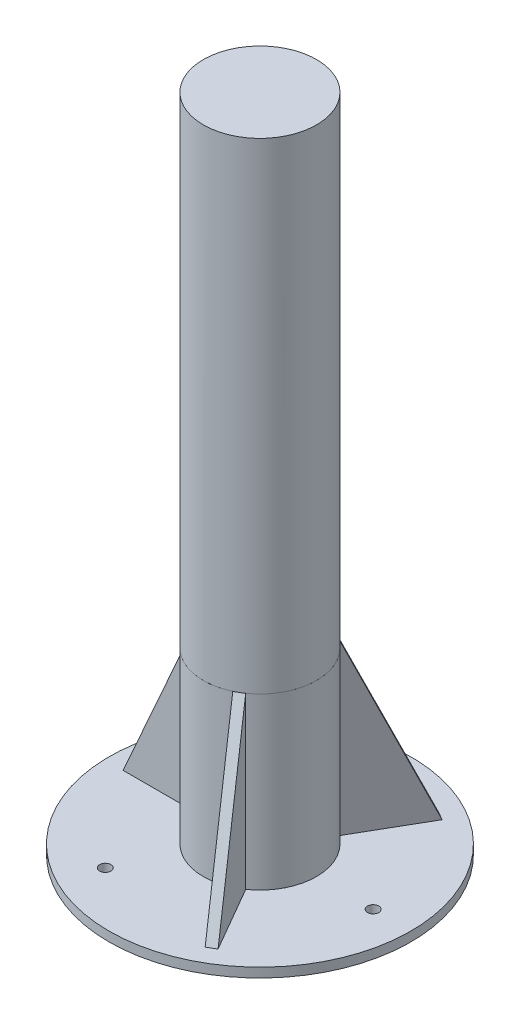
ISO-10303-21;
HEADER;
FILE_DESCRIPTION(('STEP AP214'),'2;1');
FILE_NAME('part.step','',(''),(''),'','','');
FILE_SCHEMA(('AUTOMOTIVE_DESIGN { 1 0 10303 214 1 1 1 1 }'));
ENDSEC;
DATA;
#1=APPLICATION_CONTEXT('core data for automotive mechanical design processes');
#2=APPLICATION_PROTOCOL_DEFINITION('international standard','automotive_design',2000,#1);
#3=PRODUCT_CONTEXT('',#1,'mechanical');
#4=PRODUCT('Part','Part','',(#3));
#5=PRODUCT_RELATED_PRODUCT_CATEGORY('part','',(#4));
#6=PRODUCT_DEFINITION_FORMATION('','',#4);
#7=PRODUCT_DEFINITION_CONTEXT('part definition',#1,'design');
#8=PRODUCT_DEFINITION('design','',#6,#7);
#9=PRODUCT_DEFINITION_SHAPE('','',#8);
#10=(LENGTH_UNIT() NAMED_UNIT(*) SI_UNIT(.MILLI.,.METRE.));
#11=(NAMED_UNIT(*) PLANE_ANGLE_UNIT() SI_UNIT($,.RADIAN.));
#12=(NAMED_UNIT(*) SI_UNIT($,.STERADIAN.) SOLID_ANGLE_UNIT());
#13=UNCERTAINTY_MEASURE_WITH_UNIT(LENGTH_MEASURE(1.E-05),#10,'distance_accuracy_value','');
#14=(GEOMETRIC_REPRESENTATION_CONTEXT(3) GLOBAL_UNCERTAINTY_ASSIGNED_CONTEXT((#13)) GLOBAL_UNIT_ASSIGNED_CONTEXT((#10,
#11,#12)) REPRESENTATION_CONTEXT('',''));
#15=CARTESIAN_POINT('',(0.,0.,0.));
#16=DIRECTION('',(0.,0.,1.));
#17=DIRECTION('',(1.,0.,0.));
#18=AXIS2_PLACEMENT_3D('',#15,#16,#17);
#19=CARTESIAN_POINT('',(-30.,90.,-2.5));
#20=DIRECTION('',(-0.913811548620257,0.406138466053448,0.));
#21=DIRECTION('',(-0.406138466053448,-0.913811548620257,0.));
#22=AXIS2_PLACEMENT_3D('',#19,#20,#21);
#23=PLANE('',#22);
#24=DIRECTION('',(0.,0.,1.));
#25=VECTOR('',#24,1.);
#26=CARTESIAN_POINT('',(-70.,0.,-2.5));
#27=LINE('',#26,#25);
#28=CARTESIAN_POINT('',(-70.,0.,-2.5));
#29=VERTEX_POINT('',#28);
#30=CARTESIAN_POINT('',(-70.,0.,2.5));
#31=VERTEX_POINT('',#30);
#32=EDGE_CURVE('E48',#29,#31,#27,.T.);
#33=ORIENTED_EDGE('',*,*,#32,.T.);
#34=DIRECTION('',(-0.406138466053448,-0.913811548620257,0.));
#35=VECTOR('',#34,1.);
#36=CARTESIAN_POINT('',(-30.,90.,2.5));
#37=LINE('',#36,#35);
#38=CARTESIAN_POINT('',(-30.,90.,2.5));
#39=VERTEX_POINT('',#38);
#40=EDGE_CURVE('E79',#39,#31,#37,.T.);
#41=ORIENTED_EDGE('',*,*,#40,.F.);
#42=DIRECTION('',(0.,0.,1.));
#43=VECTOR('',#42,1.);
#44=CARTESIAN_POINT('',(-30.,90.,-2.5));
#45=LINE('',#44,#43);
#46=CARTESIAN_POINT('',(-30.,90.,-2.5));
#47=VERTEX_POINT('',#46);
#48=EDGE_CURVE('E12',#47,#39,#45,.T.);
#49=ORIENTED_EDGE('',*,*,#48,.F.);
#50=DIRECTION('',(-0.406138466053448,-0.913811548620257,0.));
#51=VECTOR('',#50,1.);
#52=CARTESIAN_POINT('',(-30.,90.,-2.5));
#53=LINE('',#52,#51);
#54=EDGE_CURVE('E80',#47,#29,#53,.T.);
#55=ORIENTED_EDGE('',*,*,#54,.T.);
#56=EDGE_LOOP('',(#33,#41,#49,#55));
#57=FACE_BOUND('',#56,.T.);
#58=ADVANCED_FACE('F45',(#57),#23,.T.);
#59=CARTESIAN_POINT('',(-30.,0.,-2.5));
#60=DIRECTION('',(1.,0.,0.));
#61=DIRECTION('',(0.,0.,-1.));
#62=AXIS2_PLACEMENT_3D('',#59,#60,#61);
#63=PLANE('',#62);
#64=ORIENTED_EDGE('',*,*,#48,.T.);
#65=DIRECTION('',(0.,1.,0.));
#66=VECTOR('',#65,1.);
#67=CARTESIAN_POINT('',(-30.,0.,2.5));
#68=LINE('',#67,#66);
#69=CARTESIAN_POINT('',(-30.,0.,2.5));
#70=VERTEX_POINT('',#69);
#71=EDGE_CURVE('E89',#70,#39,#68,.T.);
#72=ORIENTED_EDGE('',*,*,#71,.F.);
#73=DIRECTION('',(0.,0.,1.));
#74=VECTOR('',#73,1.);
#75=CARTESIAN_POINT('',(-30.,0.,-2.5));
#76=LINE('',#75,#74);
#77=CARTESIAN_POINT('',(-30.,0.,-2.5));
#78=VERTEX_POINT('',#77);
#79=EDGE_CURVE('E53',#78,#70,#76,.T.);
#80=ORIENTED_EDGE('',*,*,#79,.F.);
#81=DIRECTION('',(0.,1.,0.));
#82=VECTOR('',#81,1.);
#83=CARTESIAN_POINT('',(-30.,0.,-2.5));
#84=LINE('',#83,#82);
#85=EDGE_CURVE('E83',#78,#47,#84,.T.);
#86=ORIENTED_EDGE('',*,*,#85,.T.);
#87=EDGE_LOOP('',(#64,#72,#80,#86));
#88=FACE_BOUND('',#87,.T.);
#89=ADVANCED_FACE('F99',(#88),#63,.T.);
#90=CARTESIAN_POINT('',(-70.,0.,-2.5));
#91=DIRECTION('',(0.,-1.,0.));
#92=DIRECTION('',(0.,0.,-1.));
#93=AXIS2_PLACEMENT_3D('',#90,#91,#92);
#94=PLANE('',#93);
#95=ORIENTED_EDGE('',*,*,#79,.T.);
#96=DIRECTION('',(1.,0.,0.));
#97=VECTOR('',#96,1.);
#98=CARTESIAN_POINT('',(-70.,0.,2.5));
#99=LINE('',#98,#97);
#100=EDGE_CURVE('E85',#31,#70,#99,.T.);
#101=ORIENTED_EDGE('',*,*,#100,.F.);
#102=ORIENTED_EDGE('',*,*,#32,.F.);
#103=DIRECTION('',(1.,0.,0.));
#104=VECTOR('',#103,1.);
#105=CARTESIAN_POINT('',(-70.,0.,-2.5));
#106=LINE('',#105,#104);
#107=EDGE_CURVE('E96',#29,#78,#106,.T.);
#108=ORIENTED_EDGE('',*,*,#107,.T.);
#109=EDGE_LOOP('',(#95,#101,#102,#108));
#110=FACE_BOUND('',#109,.T.);
#111=ADVANCED_FACE('F86',(#110),#94,.T.);
#112=CARTESIAN_POINT('',(0.,0.,-2.5));
#113=DIRECTION('',(0.,0.,1.));
#114=DIRECTION('',(1.,0.,0.));
#115=AXIS2_PLACEMENT_3D('',#112,#113,#114);
#116=PLANE('',#115);
#117=ORIENTED_EDGE('',*,*,#54,.F.);
#118=ORIENTED_EDGE('',*,*,#85,.F.);
#119=ORIENTED_EDGE('',*,*,#107,.F.);
#120=EDGE_LOOP('',(#117,#118,#119));
#121=FACE_BOUND('',#120,.T.);
#122=ADVANCED_FACE('F101',(#121),#116,.F.);
#123=CARTESIAN_POINT('',(0.,0.,2.5));
#124=DIRECTION('',(0.,0.,1.));
#125=DIRECTION('',(1.,0.,0.));
#126=AXIS2_PLACEMENT_3D('',#123,#124,#125);
#127=PLANE('',#126);
#128=ORIENTED_EDGE('',*,*,#40,.T.);
#129=ORIENTED_EDGE('',*,*,#100,.T.);
#130=ORIENTED_EDGE('',*,*,#71,.T.);
#131=EDGE_LOOP('',(#128,#129,#130));
#132=FACE_BOUND('',#131,.T.);
#133=ADVANCED_FACE('F91',(#132),#127,.T.);
#134=CLOSED_SHELL('',(#58,#89,#111,#122,#133));
#135=MANIFOLD_SOLID_BREP('B2',#134);
#136=CARTESIAN_POINT('',(0.,345.,0.));
#137=DIRECTION('',(0.,-1.,0.));
#138=DIRECTION('',(0.,0.,-1.));
#139=AXIS2_PLACEMENT_3D('',#136,#137,#138);
#140=CYLINDRICAL_SURFACE('',#139,30.);
#141=CARTESIAN_POINT('',(0.,345.,0.));
#142=DIRECTION('',(0.,1.,0.));
#143=DIRECTION('',(0.,0.,1.));
#144=AXIS2_PLACEMENT_3D('',#141,#142,#143);
#145=CIRCLE('',#144,30.);
#146=CARTESIAN_POINT('',(0.,345.,30.));
#147=VERTEX_POINT('',#146);
#148=EDGE_CURVE('E43',#147,#147,#145,.T.);
#149=ORIENTED_EDGE('',*,*,#148,.F.);
#150=EDGE_LOOP('',(#149));
#151=FACE_BOUND('',#150,.T.);
#152=CARTESIAN_POINT('',(0.,90.,0.));
#153=DIRECTION('',(0.,1.,0.));
#154=DIRECTION('',(0.,0.,1.));
#155=AXIS2_PLACEMENT_3D('',#152,#153,#154);
#156=CIRCLE('',#155,30.);
#157=CARTESIAN_POINT('',(15.0000000000001,90.,-25.9807621135331));
#158=VERTEX_POINT('',#157);
#159=CARTESIAN_POINT('',(14.9999999999998,90.,25.9807621135333));
#160=VERTEX_POINT('',#159);
#161=EDGE_CURVE('E153',#158,#160,#156,.T.);
#162=ORIENTED_EDGE('',*,*,#161,.T.);
#163=EDGE_CURVE('E163',#160,#158,#156,.T.);
#164=ORIENTED_EDGE('',*,*,#163,.T.);
#165=EDGE_LOOP('',(#162,#164));
#166=FACE_BOUND('',#165,.T.);
#167=ADVANCED_FACE('F150',(#151,#166),#140,.T.);
#168=CARTESIAN_POINT('',(0.,345.,0.));
#169=DIRECTION('',(0.,1.,0.));
#170=DIRECTION('',(0.,0.,1.));
#171=AXIS2_PLACEMENT_3D('',#168,#169,#170);
#172=PLANE('',#171);
#173=ORIENTED_EDGE('',*,*,#148,.T.);
#174=EDGE_LOOP('',(#173));
#175=FACE_BOUND('',#174,.T.);
#176=ADVANCED_FACE('F168',(#175),#172,.T.);
#177=CARTESIAN_POINT('',(0.,90.,0.));
#178=DIRECTION('',(0.,1.,0.));
#179=DIRECTION('',(0.,0.,1.));
#180=AXIS2_PLACEMENT_3D('',#177,#178,#179);
#181=PLANE('',#180);
#182=ORIENTED_EDGE('',*,*,#161,.F.);
#183=ORIENTED_EDGE('',*,*,#163,.F.);
#184=EDGE_LOOP('',(#182,#183));
#185=FACE_BOUND('',#184,.T.);
#186=ADVANCED_FACE('F166',(#185),#181,.F.);
#187=CLOSED_SHELL('',(#167,#176,#186));
#188=MANIFOLD_SOLID_BREP('B6',#187);
#189=CARTESIAN_POINT('',(0.,90.,0.));
#190=DIRECTION('',(0.,-1.,0.));
#191=DIRECTION('',(0.,0.,-1.));
#192=AXIS2_PLACEMENT_3D('',#189,#190,#191);
#193=CYLINDRICAL_SURFACE('',#192,30.);
#194=CARTESIAN_POINT('',(0.,0.,0.));
#195=DIRECTION('',(0.,1.,0.));
#196=DIRECTION('',(0.,0.,1.));
#197=AXIS2_PLACEMENT_3D('',#194,#195,#196);
#198=CIRCLE('',#197,30.);
#199=CARTESIAN_POINT('',(0.,0.,30.));
#200=VERTEX_POINT('',#199);
#201=EDGE_CURVE('E207',#200,#200,#198,.T.);
#202=ORIENTED_EDGE('',*,*,#201,.T.);
#203=EDGE_LOOP('',(#202));
#204=FACE_BOUND('',#203,.T.);
#205=CARTESIAN_POINT('',(0.,90.,0.));
#206=DIRECTION('',(0.,1.,0.));
#207=DIRECTION('',(0.,0.,1.));
#208=AXIS2_PLACEMENT_3D('',#205,#206,#207);
#209=CIRCLE('',#208,30.);
#210=CARTESIAN_POINT('',(0.,90.,30.));
#211=VERTEX_POINT('',#210);
#212=EDGE_CURVE('E149',#211,#211,#209,.T.);
#213=ORIENTED_EDGE('',*,*,#212,.F.);
#214=EDGE_LOOP('',(#213));
#215=FACE_BOUND('',#214,.T.);
#216=ADVANCED_FACE('F204',(#204,#215),#193,.T.);
#217=CARTESIAN_POINT('',(0.,90.,0.));
#218=DIRECTION('',(0.,1.,0.));
#219=DIRECTION('',(0.,0.,1.));
#220=AXIS2_PLACEMENT_3D('',#217,#218,#219);
#221=PLANE('',#220);
#222=ORIENTED_EDGE('',*,*,#212,.T.);
#223=EDGE_LOOP('',(#222));
#224=FACE_BOUND('',#223,.T.);
#225=ADVANCED_FACE('F220',(#224),#221,.T.);
#226=CARTESIAN_POINT('',(0.,0.,0.));
#227=DIRECTION('',(0.,1.,0.));
#228=DIRECTION('',(0.,0.,1.));
#229=AXIS2_PLACEMENT_3D('',#226,#227,#228);
#230=PLANE('',#229);
#231=ORIENTED_EDGE('',*,*,#201,.F.);
#232=EDGE_LOOP('',(#231));
#233=FACE_BOUND('',#232,.T.);
#234=ADVANCED_FACE('F218',(#233),#230,.F.);
#235=CLOSED_SHELL('',(#216,#225,#234));
#236=MANIFOLD_SOLID_BREP('B37',#235);
#237=CARTESIAN_POINT('',(0.,0.,0.));
#238=DIRECTION('',(0.,1.,0.));
#239=DIRECTION('',(0.,0.,1.));
#240=AXIS2_PLACEMENT_3D('',#237,#238,#239);
#241=PLANE('',#240);
#242=CARTESIAN_POINT('',(-30.0000000000006,0.,-51.961524227066));
#243=DIRECTION('',(0.,1.,0.));
#244=DIRECTION('',(0.,0.,1.));
#245=AXIS2_PLACEMENT_3D('',#242,#243,#244);
#246=CIRCLE('',#245,3.);
#247=CARTESIAN_POINT('',(-30.0000000000006,0.,-48.961524227066));
#248=VERTEX_POINT('',#247);
#249=EDGE_CURVE('E415',#248,#248,#246,.T.);
#250=ORIENTED_EDGE('',*,*,#249,.F.);
#251=EDGE_LOOP('',(#250));
#252=FACE_BOUND('',#251,.T.);
#253=CARTESIAN_POINT('',(60.0000000000015,0.,-3.21723326152867E-12));
#254=DIRECTION('',(0.,1.,0.));
#255=DIRECTION('',(0.,0.,1.));
#256=AXIS2_PLACEMENT_3D('',#253,#254,#255);
#257=CIRCLE('',#256,3.00000000000309);
#258=CARTESIAN_POINT('',(60.0000000000015,0.,2.99999999999987));
#259=VERTEX_POINT('',#258);
#260=EDGE_CURVE('E420',#259,#259,#257,.T.);
#261=ORIENTED_EDGE('',*,*,#260,.F.);
#262=EDGE_LOOP('',(#261));
#263=FACE_BOUND('',#262,.T.);
#264=CARTESIAN_POINT('',(-29.9999999999965,0.,51.9615242270667));
#265=DIRECTION('',(0.,1.,0.));
#266=DIRECTION('',(0.,0.,1.));
#267=AXIS2_PLACEMENT_3D('',#264,#265,#266);
#268=CIRCLE('',#267,3.00000000000271);
#269=CARTESIAN_POINT('',(-29.9999999999965,0.,54.9615242270694));
#270=VERTEX_POINT('',#269);
#271=EDGE_CURVE('E428',#270,#270,#268,.T.);
#272=ORIENTED_EDGE('',*,*,#271,.F.);
#273=EDGE_LOOP('',(#272));
#274=FACE_BOUND('',#273,.T.);
#275=CARTESIAN_POINT('',(0.,0.,0.));
#276=DIRECTION('',(0.,1.,0.));
#277=DIRECTION('',(0.,0.,1.));
#278=AXIS2_PLACEMENT_3D('',#275,#276,#277);
#279=CIRCLE('',#278,80.);
#280=CARTESIAN_POINT('',(0.,0.,80.));
#281=VERTEX_POINT('',#280);
#282=EDGE_CURVE('E248',#281,#281,#279,.T.);
#283=ORIENTED_EDGE('',*,*,#282,.T.);
#284=EDGE_LOOP('',(#283));
#285=FACE_BOUND('',#284,.T.);
#286=DIRECTION('',(-0.866025403784436,0.,-0.500000000000004));
#287=VECTOR('',#286,1.);
#288=CARTESIAN_POINT('',(37.1650635094614,0.,-59.3717782649106));
#289=LINE('',#288,#287);
#290=CARTESIAN_POINT('',(37.1650635094614,0.,-59.3717782649105));
#291=VERTEX_POINT('',#290);
#292=CARTESIAN_POINT('',(32.8349364905392,0.,-61.8717782649106));
#293=VERTEX_POINT('',#292);
#294=EDGE_CURVE('E323',#291,#293,#289,.T.);
#295=ORIENTED_EDGE('',*,*,#294,.F.);
#296=DIRECTION('',(-0.500000000000004,0.,0.866025403784436));
#297=VECTOR('',#296,1.);
#298=CARTESIAN_POINT('',(37.1650635094614,0.,-59.3717782649106));
#299=LINE('',#298,#297);
#300=CARTESIAN_POINT('',(17.1650635094612,0.,-24.7307621135331));
#301=VERTEX_POINT('',#300);
#302=EDGE_CURVE('E346',#291,#301,#299,.T.);
#303=ORIENTED_EDGE('',*,*,#302,.T.);
#304=DIRECTION('',(-0.866025403784436,0.,-0.500000000000004));
#305=VECTOR('',#304,1.);
#306=CARTESIAN_POINT('',(17.1650635094612,0.,-24.7307621135331));
#307=LINE('',#306,#305);
#308=CARTESIAN_POINT('',(12.834936490539,0.,-27.2307621135331));
#309=VERTEX_POINT('',#308);
#310=EDGE_CURVE('E338',#301,#309,#307,.T.);
#311=ORIENTED_EDGE('',*,*,#310,.T.);
#312=DIRECTION('',(-0.500000000000004,0.,0.866025403784436));
#313=VECTOR('',#312,1.);
#314=CARTESIAN_POINT('',(32.8349364905392,0.,-61.8717782649106));
#315=LINE('',#314,#313);
#316=EDGE_CURVE('E343',#293,#309,#315,.T.);
#317=ORIENTED_EDGE('',*,*,#316,.F.);
#318=EDGE_LOOP('',(#295,#303,#311,#317));
#319=FACE_BOUND('',#318,.T.);
#320=DIRECTION('',(0.866025403784443,0.,-0.499999999999992));
#321=VECTOR('',#320,1.);
#322=CARTESIAN_POINT('',(32.8349364905383,0.,61.871778264911));
#323=LINE('',#322,#321);
#324=CARTESIAN_POINT('',(32.8349364905383,0.,61.871778264911));
#325=VERTEX_POINT('',#324);
#326=CARTESIAN_POINT('',(37.1650635094605,0.,59.3717782649111));
#327=VERTEX_POINT('',#326);
#328=EDGE_CURVE('E259',#325,#327,#323,.T.);
#329=ORIENTED_EDGE('',*,*,#328,.F.);
#330=DIRECTION('',(-0.499999999999992,0.,-0.866025403784443));
#331=VECTOR('',#330,1.);
#332=CARTESIAN_POINT('',(32.8349364905383,0.,61.871778264911));
#333=LINE('',#332,#331);
#334=CARTESIAN_POINT('',(12.8349364905386,0.,27.2307621135333));
#335=VERTEX_POINT('',#334);
#336=EDGE_CURVE('E264',#325,#335,#333,.T.);
#337=ORIENTED_EDGE('',*,*,#336,.T.);
#338=DIRECTION('',(0.866025403784443,0.,-0.499999999999992));
#339=VECTOR('',#338,1.);
#340=CARTESIAN_POINT('',(12.8349364905386,0.,27.2307621135333));
#341=LINE('',#340,#339);
#342=CARTESIAN_POINT('',(17.1650635094609,0.,24.7307621135333));
#343=VERTEX_POINT('',#342);
#344=EDGE_CURVE('E315',#335,#343,#341,.T.);
#345=ORIENTED_EDGE('',*,*,#344,.T.);
#346=DIRECTION('',(-0.499999999999992,0.,-0.866025403784443));
#347=VECTOR('',#346,1.);
#348=CARTESIAN_POINT('',(37.1650635094605,0.,59.3717782649111));
#349=LINE('',#348,#347);
#350=EDGE_CURVE('E314',#327,#343,#349,.T.);
#351=ORIENTED_EDGE('',*,*,#350,.F.);
#352=EDGE_LOOP('',(#329,#337,#345,#351));
#353=FACE_BOUND('',#352,.T.);
#354=ADVANCED_FACE('F244',(#252,#263,#274,#285,#319,#353),#241,.T.);
#355=CARTESIAN_POINT('',(0.,-5.,0.));
#356=DIRECTION('',(0.,1.,0.));
#357=DIRECTION('',(0.,0.,1.));
#358=AXIS2_PLACEMENT_3D('',#355,#356,#357);
#359=CYLINDRICAL_SURFACE('',#358,80.);
#360=CARTESIAN_POINT('',(0.,-5.,0.));
#361=DIRECTION('',(0.,1.,0.));
#362=DIRECTION('',(0.,0.,1.));
#363=AXIS2_PLACEMENT_3D('',#360,#361,#362);
#364=CIRCLE('',#363,80.);
#365=CARTESIAN_POINT('',(0.,-5.,80.));
#366=VERTEX_POINT('',#365);
#367=EDGE_CURVE('E202',#366,#366,#364,.T.);
#368=ORIENTED_EDGE('',*,*,#367,.T.);
#369=EDGE_LOOP('',(#368));
#370=FACE_BOUND('',#369,.T.);
#371=ORIENTED_EDGE('',*,*,#282,.F.);
#372=EDGE_LOOP('',(#371));
#373=FACE_BOUND('',#372,.T.);
#374=ADVANCED_FACE('F246',(#370,#373),#359,.T.);
#375=CARTESIAN_POINT('',(0.,-5.,0.));
#376=DIRECTION('',(0.,1.,0.));
#377=DIRECTION('',(0.,0.,1.));
#378=AXIS2_PLACEMENT_3D('',#375,#376,#377);
#379=PLANE('',#378);
#380=CARTESIAN_POINT('',(-30.0000000000006,-5.,-51.961524227066));
#381=DIRECTION('',(0.,1.,0.));
#382=DIRECTION('',(0.,0.,1.));
#383=AXIS2_PLACEMENT_3D('',#380,#381,#382);
#384=CIRCLE('',#383,3.);
#385=CARTESIAN_POINT('',(-30.0000000000006,-5.,-48.961524227066));
#386=VERTEX_POINT('',#385);
#387=EDGE_CURVE('E413',#386,#386,#384,.T.);
#388=ORIENTED_EDGE('',*,*,#387,.T.);
#389=EDGE_LOOP('',(#388));
#390=FACE_BOUND('',#389,.T.);
#391=CARTESIAN_POINT('',(60.0000000000015,-5.,-3.21723326152867E-12));
#392=DIRECTION('',(0.,1.,0.));
#393=DIRECTION('',(0.,0.,1.));
#394=AXIS2_PLACEMENT_3D('',#391,#392,#393);
#395=CIRCLE('',#394,3.00000000000309);
#396=CARTESIAN_POINT('',(60.0000000000015,-5.,2.99999999999987));
#397=VERTEX_POINT('',#396);
#398=EDGE_CURVE('E416',#397,#397,#395,.T.);
#399=ORIENTED_EDGE('',*,*,#398,.T.);
#400=EDGE_LOOP('',(#399));
#401=FACE_BOUND('',#400,.T.);
#402=CARTESIAN_POINT('',(-29.9999999999965,-5.,51.9615242270667));
#403=DIRECTION('',(0.,1.,0.));
#404=DIRECTION('',(0.,0.,1.));
#405=AXIS2_PLACEMENT_3D('',#402,#403,#404);
#406=CIRCLE('',#405,3.00000000000271);
#407=CARTESIAN_POINT('',(-29.9999999999965,-5.,54.9615242270694));
#408=VERTEX_POINT('',#407);
#409=EDGE_CURVE('E425',#408,#408,#406,.T.);
#410=ORIENTED_EDGE('',*,*,#409,.T.);
#411=EDGE_LOOP('',(#410));
#412=FACE_BOUND('',#411,.T.);
#413=ORIENTED_EDGE('',*,*,#367,.F.);
#414=EDGE_LOOP('',(#413));
#415=FACE_BOUND('',#414,.T.);
#416=ADVANCED_FACE('F355',(#390,#401,#412,#415),#379,.F.);
#417=CARTESIAN_POINT('',(17.1650635094612,90.,-24.7307621135331));
#418=DIRECTION('',(0.456905774310132,0.406138466053448,-0.791384015376739));
#419=DIRECTION('',(0.203069233026726,-0.913811548620257,-0.351726229056329));
#420=AXIS2_PLACEMENT_3D('',#417,#418,#419);
#421=PLANE('',#420);
#422=ORIENTED_EDGE('',*,*,#294,.T.);
#423=DIRECTION('',(0.203069233026726,-0.913811548620257,-0.351726229056329));
#424=VECTOR('',#423,1.);
#425=CARTESIAN_POINT('',(12.834936490539,90.,-27.2307621135331));
#426=LINE('',#425,#424);
#427=CARTESIAN_POINT('',(12.834936490539,90.,-27.2307621135331));
#428=VERTEX_POINT('',#427);
#429=EDGE_CURVE('E326',#428,#293,#426,.T.);
#430=ORIENTED_EDGE('',*,*,#429,.F.);
#431=DIRECTION('',(-0.866025403784436,0.,-0.500000000000004));
#432=VECTOR('',#431,1.);
#433=CARTESIAN_POINT('',(17.1650635094612,90.,-24.7307621135331));
#434=LINE('',#433,#432);
#435=CARTESIAN_POINT('',(17.1650635094612,90.,-24.7307621135331));
#436=VERTEX_POINT('',#435);
#437=EDGE_CURVE('E329',#436,#428,#434,.T.);
#438=ORIENTED_EDGE('',*,*,#437,.F.);
#439=DIRECTION('',(0.203069233026726,-0.913811548620257,-0.351726229056329));
#440=VECTOR('',#439,1.);
#441=CARTESIAN_POINT('',(17.1650635094612,90.,-24.7307621135331));
#442=LINE('',#441,#440);
#443=EDGE_CURVE('E332',#436,#291,#442,.T.);
#444=ORIENTED_EDGE('',*,*,#443,.T.);
#445=EDGE_LOOP('',(#422,#430,#438,#444));
#446=FACE_BOUND('',#445,.T.);
#447=ADVANCED_FACE('F361',(#446),#421,.T.);
#448=CARTESIAN_POINT('',(17.1650635094612,0.,-24.7307621135331));
#449=DIRECTION('',(-0.500000000000004,0.,0.866025403784436));
#450=DIRECTION('',(0.866025403784436,0.,0.500000000000004));
#451=AXIS2_PLACEMENT_3D('',#448,#449,#450);
#452=PLANE('',#451);
#453=ORIENTED_EDGE('',*,*,#437,.T.);
#454=DIRECTION('',(0.,1.,0.));
#455=VECTOR('',#454,1.);
#456=CARTESIAN_POINT('',(12.834936490539,0.,-27.2307621135331));
#457=LINE('',#456,#455);
#458=EDGE_CURVE('E335',#309,#428,#457,.T.);
#459=ORIENTED_EDGE('',*,*,#458,.F.);
#460=ORIENTED_EDGE('',*,*,#310,.F.);
#461=DIRECTION('',(0.,1.,0.));
#462=VECTOR('',#461,1.);
#463=CARTESIAN_POINT('',(17.1650635094612,0.,-24.7307621135331));
#464=LINE('',#463,#462);
#465=EDGE_CURVE('E340',#301,#436,#464,.T.);
#466=ORIENTED_EDGE('',*,*,#465,.T.);
#467=EDGE_LOOP('',(#453,#459,#460,#466));
#468=FACE_BOUND('',#467,.T.);
#469=ADVANCED_FACE('F379',(#468),#452,.T.);
#470=CARTESIAN_POINT('',(2.16506350946109,0.,1.25000000000001));
#471=DIRECTION('',(-0.866025403784436,0.,-0.500000000000004));
#472=DIRECTION('',(-0.500000000000004,0.,0.866025403784436));
#473=AXIS2_PLACEMENT_3D('',#470,#471,#472);
#474=PLANE('',#473);
#475=ORIENTED_EDGE('',*,*,#443,.F.);
#476=ORIENTED_EDGE('',*,*,#465,.F.);
#477=ORIENTED_EDGE('',*,*,#302,.F.);
#478=EDGE_LOOP('',(#475,#476,#477));
#479=FACE_BOUND('',#478,.T.);
#480=ADVANCED_FACE('F375',(#479),#474,.F.);
#481=CARTESIAN_POINT('',(-2.16506350946109,0.,-1.25000000000001));
#482=DIRECTION('',(-0.866025403784436,0.,-0.500000000000004));
#483=DIRECTION('',(-0.500000000000004,0.,0.866025403784436));
#484=AXIS2_PLACEMENT_3D('',#481,#482,#483);
#485=PLANE('',#484);
#486=ORIENTED_EDGE('',*,*,#429,.T.);
#487=ORIENTED_EDGE('',*,*,#316,.T.);
#488=ORIENTED_EDGE('',*,*,#458,.T.);
#489=EDGE_LOOP('',(#486,#487,#488));
#490=FACE_BOUND('',#489,.T.);
#491=ADVANCED_FACE('F364',(#490),#485,.T.);
#492=CARTESIAN_POINT('',(12.8349364905386,90.,27.2307621135333));
#493=DIRECTION('',(0.456905774310121,0.406138466053448,0.791384015376746));
#494=DIRECTION('',(0.203069233026721,-0.913811548620257,0.351726229056331));
#495=AXIS2_PLACEMENT_3D('',#492,#493,#494);
#496=PLANE('',#495);
#497=ORIENTED_EDGE('',*,*,#328,.T.);
#498=DIRECTION('',(0.203069233026721,-0.913811548620257,0.351726229056331));
#499=VECTOR('',#498,1.);
#500=CARTESIAN_POINT('',(17.1650635094609,90.,24.7307621135333));
#501=LINE('',#500,#499);
#502=CARTESIAN_POINT('',(17.1650635094609,90.,24.7307621135333));
#503=VERTEX_POINT('',#502);
#504=EDGE_CURVE('E295',#503,#327,#501,.T.);
#505=ORIENTED_EDGE('',*,*,#504,.F.);
#506=DIRECTION('',(0.866025403784443,0.,-0.499999999999992));
#507=VECTOR('',#506,1.);
#508=CARTESIAN_POINT('',(12.8349364905386,90.,27.2307621135333));
#509=LINE('',#508,#507);
#510=CARTESIAN_POINT('',(12.8349364905386,90.,27.2307621135333));
#511=VERTEX_POINT('',#510);
#512=EDGE_CURVE('E298',#511,#503,#509,.T.);
#513=ORIENTED_EDGE('',*,*,#512,.F.);
#514=DIRECTION('',(0.203069233026721,-0.913811548620257,0.351726229056331));
#515=VECTOR('',#514,1.);
#516=CARTESIAN_POINT('',(12.8349364905386,90.,27.2307621135333));
#517=LINE('',#516,#515);
#518=EDGE_CURVE('E311',#511,#325,#517,.T.);
#519=ORIENTED_EDGE('',*,*,#518,.T.);
#520=EDGE_LOOP('',(#497,#505,#513,#519));
#521=FACE_BOUND('',#520,.T.);
#522=ADVANCED_FACE('F297',(#521),#496,.T.);
#523=CARTESIAN_POINT('',(12.8349364905386,0.,27.2307621135333));
#524=DIRECTION('',(-0.499999999999992,0.,-0.866025403784443));
#525=DIRECTION('',(-0.866025403784443,0.,0.499999999999992));
#526=AXIS2_PLACEMENT_3D('',#523,#524,#525);
#527=PLANE('',#526);
#528=ORIENTED_EDGE('',*,*,#512,.T.);
#529=DIRECTION('',(0.,1.,0.));
#530=VECTOR('',#529,1.);
#531=CARTESIAN_POINT('',(17.1650635094609,0.,24.7307621135333));
#532=LINE('',#531,#530);
#533=EDGE_CURVE('E308',#343,#503,#532,.T.);
#534=ORIENTED_EDGE('',*,*,#533,.F.);
#535=ORIENTED_EDGE('',*,*,#344,.F.);
#536=DIRECTION('',(0.,1.,0.));
#537=VECTOR('',#536,1.);
#538=CARTESIAN_POINT('',(12.8349364905386,0.,27.2307621135333));
#539=LINE('',#538,#537);
#540=EDGE_CURVE('E310',#335,#511,#539,.T.);
#541=ORIENTED_EDGE('',*,*,#540,.T.);
#542=EDGE_LOOP('',(#528,#534,#535,#541));
#543=FACE_BOUND('',#542,.T.);
#544=ADVANCED_FACE('F307',(#543),#527,.T.);
#545=CARTESIAN_POINT('',(-2.16506350946111,0.,1.24999999999998));
#546=DIRECTION('',(0.866025403784443,0.,-0.499999999999992));
#547=DIRECTION('',(-0.499999999999992,0.,-0.866025403784443));
#548=AXIS2_PLACEMENT_3D('',#545,#546,#547);
#549=PLANE('',#548);
#550=ORIENTED_EDGE('',*,*,#518,.F.);
#551=ORIENTED_EDGE('',*,*,#540,.F.);
#552=ORIENTED_EDGE('',*,*,#336,.F.);
#553=EDGE_LOOP('',(#550,#551,#552));
#554=FACE_BOUND('',#553,.T.);
#555=ADVANCED_FACE('F390',(#554),#549,.F.);
#556=CARTESIAN_POINT('',(2.16506350946111,0.,-1.24999999999998));
#557=DIRECTION('',(0.866025403784443,0.,-0.499999999999992));
#558=DIRECTION('',(-0.499999999999992,0.,-0.866025403784443));
#559=AXIS2_PLACEMENT_3D('',#556,#557,#558);
#560=PLANE('',#559);
#561=ORIENTED_EDGE('',*,*,#504,.T.);
#562=ORIENTED_EDGE('',*,*,#350,.T.);
#563=ORIENTED_EDGE('',*,*,#533,.T.);
#564=EDGE_LOOP('',(#561,#562,#563));
#565=FACE_BOUND('',#564,.T.);
#566=ADVANCED_FACE('F313',(#565),#560,.T.);
#567=CARTESIAN_POINT('',(-29.9999999999965,-5.,51.9615242270667));
#568=DIRECTION('',(0.,1.,0.));
#569=DIRECTION('',(0.,0.,1.));
#570=AXIS2_PLACEMENT_3D('',#567,#568,#569);
#571=CYLINDRICAL_SURFACE('',#570,3.00000000000271);
#572=ORIENTED_EDGE('',*,*,#409,.F.);
#573=EDGE_LOOP('',(#572));
#574=FACE_BOUND('',#573,.T.);
#575=ORIENTED_EDGE('',*,*,#271,.T.);
#576=EDGE_LOOP('',(#575));
#577=FACE_BOUND('',#576,.T.);
#578=ADVANCED_FACE('F389',(#574,#577),#571,.F.);
#579=CARTESIAN_POINT('',(60.0000000000015,-5.,-3.21723326152867E-12));
#580=DIRECTION('',(0.,1.,0.));
#581=DIRECTION('',(0.,0.,1.));
#582=AXIS2_PLACEMENT_3D('',#579,#580,#581);
#583=CYLINDRICAL_SURFACE('',#582,3.00000000000309);
#584=ORIENTED_EDGE('',*,*,#398,.F.);
#585=EDGE_LOOP('',(#584));
#586=FACE_BOUND('',#585,.T.);
#587=ORIENTED_EDGE('',*,*,#260,.T.);
#588=EDGE_LOOP('',(#587));
#589=FACE_BOUND('',#588,.T.);
#590=ADVANCED_FACE('F400',(#586,#589),#583,.F.);
#591=CARTESIAN_POINT('',(-30.0000000000006,-5.,-51.961524227066));
#592=DIRECTION('',(0.,1.,0.));
#593=DIRECTION('',(0.,0.,1.));
#594=AXIS2_PLACEMENT_3D('',#591,#592,#593);
#595=CYLINDRICAL_SURFACE('',#594,3.);
#596=ORIENTED_EDGE('',*,*,#387,.F.);
#597=EDGE_LOOP('',(#596));
#598=FACE_BOUND('',#597,.T.);
#599=ORIENTED_EDGE('',*,*,#249,.T.);
#600=EDGE_LOOP('',(#599));
#601=FACE_BOUND('',#600,.T.);
#602=ADVANCED_FACE('F404',(#598,#601),#595,.F.);
#603=CLOSED_SHELL('',(#354,#374,#416,#447,#469,#480,#491,#522,#544,#555,#566,#578,#590,#602));
#604=MANIFOLD_SOLID_BREP('B144',#603);
#605=ADVANCED_BREP_SHAPE_REPRESENTATION('',(#18,#135,#188,#236,#604),#14);
#606=SHAPE_DEFINITION_REPRESENTATION(#9,#605);
ENDSEC;
END-ISO-10303-21;
